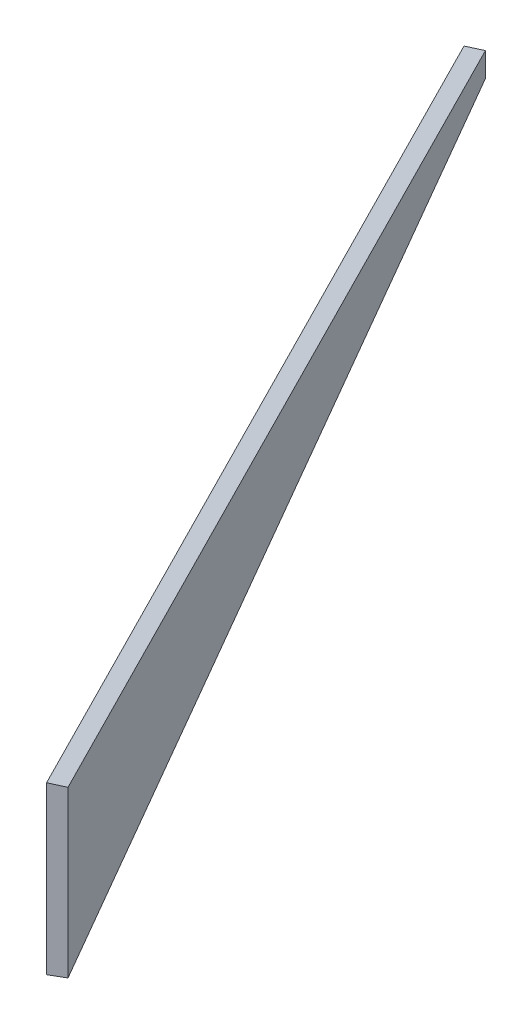
ISO-10303-21;
HEADER;
FILE_DESCRIPTION(('STEP AP214'),'2;1');
FILE_NAME('part.step','',(''),(''),'','','');
FILE_SCHEMA(('AUTOMOTIVE_DESIGN { 1 0 10303 214 1 1 1 1 }'));
ENDSEC;
DATA;
#1=APPLICATION_CONTEXT('core data for automotive mechanical design processes');
#2=APPLICATION_PROTOCOL_DEFINITION('international standard','automotive_design',2000,#1);
#3=PRODUCT_CONTEXT('',#1,'mechanical');
#4=PRODUCT('Part','Part','',(#3));
#5=PRODUCT_RELATED_PRODUCT_CATEGORY('part','',(#4));
#6=PRODUCT_DEFINITION_FORMATION('','',#4);
#7=PRODUCT_DEFINITION_CONTEXT('part definition',#1,'design');
#8=PRODUCT_DEFINITION('design','',#6,#7);
#9=PRODUCT_DEFINITION_SHAPE('','',#8);
#10=(LENGTH_UNIT() NAMED_UNIT(*) SI_UNIT(.MILLI.,.METRE.));
#11=(NAMED_UNIT(*) PLANE_ANGLE_UNIT() SI_UNIT($,.RADIAN.));
#12=(NAMED_UNIT(*) SI_UNIT($,.STERADIAN.) SOLID_ANGLE_UNIT());
#13=UNCERTAINTY_MEASURE_WITH_UNIT(LENGTH_MEASURE(1.E-05),#10,'distance_accuracy_value','');
#14=(GEOMETRIC_REPRESENTATION_CONTEXT(3) GLOBAL_UNCERTAINTY_ASSIGNED_CONTEXT((#13)) GLOBAL_UNIT_ASSIGNED_CONTEXT((#10,
#11,#12)) REPRESENTATION_CONTEXT('',''));
#15=CARTESIAN_POINT('',(0.,0.,0.));
#16=DIRECTION('',(0.,0.,1.));
#17=DIRECTION('',(1.,0.,0.));
#18=AXIS2_PLACEMENT_3D('',#15,#16,#17);
#19=CARTESIAN_POINT('',(473.075,0.,-3427.892719385));
#20=DIRECTION('',(0.866025403784429,0.,-0.500000000000017));
#21=DIRECTION('',(-0.500000000000017,0.,-0.866025403784429));
#22=AXIS2_PLACEMENT_3D('',#19,#20,#21);
#23=PLANE('',#22);
#24=DIRECTION('',(0.,1.,0.));
#25=VECTOR('',#24,1.);
#26=CARTESIAN_POINT('',(10.9985226280619,0.,-4228.23265517386));
#27=LINE('',#26,#25);
#28=CARTESIAN_POINT('',(10.998522628441,19.6298539492593,-4228.23265517409));
#29=VERTEX_POINT('',#28);
#30=CARTESIAN_POINT('',(10.998522628441,0.,-4228.23265517408));
#31=VERTEX_POINT('',#30);
#32=EDGE_CURVE('E20',#29,#31,#27,.F.);
#33=ORIENTED_EDGE('',*,*,#32,.F.);
#34=DIRECTION('',(-0.496226558532445,-0.122624673012515,-0.85948961144136));
#35=VECTOR('',#34,1.);
#36=CARTESIAN_POINT('',(473.075,133.815553949262,-3427.89271938501));
#37=LINE('',#36,#35);
#38=CARTESIAN_POINT('',(473.075000000004,133.8155539492,-3427.892719385));
#39=VERTEX_POINT('',#38);
#40=EDGE_CURVE('E79',#39,#29,#37,.T.);
#41=ORIENTED_EDGE('',*,*,#40,.F.);
#42=DIRECTION('',(0.,1.,0.));
#43=VECTOR('',#42,1.);
#44=CARTESIAN_POINT('',(473.075000000014,0.,-3427.89271938498));
#45=LINE('',#44,#43);
#46=CARTESIAN_POINT('',(473.075000000004,0.,-3427.89271938499));
#47=VERTEX_POINT('',#46);
#48=EDGE_CURVE('E61',#47,#39,#45,.T.);
#49=ORIENTED_EDGE('',*,*,#48,.F.);
#50=DIRECTION('',(-0.500000000000837,0.,-0.866025403783955));
#51=VECTOR('',#50,1.);
#52=CARTESIAN_POINT('',(473.075,0.,-3427.892719385));
#53=LINE('',#52,#51);
#54=EDGE_CURVE('E56',#47,#31,#53,.T.);
#55=ORIENTED_EDGE('',*,*,#54,.T.);
#56=EDGE_LOOP('',(#33,#41,#49,#55));
#57=FACE_BOUND('',#56,.T.);
#58=ADVANCED_FACE('F17',(#57),#23,.T.);
#59=CARTESIAN_POINT('',(10.9985226280619,0.,-4228.23265517386));
#60=DIRECTION('',(-0.499999999999898,0.,-0.866025403784497));
#61=DIRECTION('',(-0.866025403784497,0.,0.499999999999898));
#62=AXIS2_PLACEMENT_3D('',#59,#60,#61);
#63=PLANE('',#62);
#64=DIRECTION('',(0.,1.,0.));
#65=VECTOR('',#64,1.);
#66=CARTESIAN_POINT('',(0.,0.,-4221.88265517386));
#67=LINE('',#66,#65);
#68=CARTESIAN_POINT('',(-4.81062211339158E-13,20.5359000000744,-4221.88265517387));
#69=VERTEX_POINT('',#68);
#70=CARTESIAN_POINT('',(-4.84855211535518E-13,0.,-4221.88265517386));
#71=VERTEX_POINT('',#70);
#72=EDGE_CURVE('E83',#69,#71,#67,.F.);
#73=ORIENTED_EDGE('',*,*,#72,.F.);
#74=DIRECTION('',(-0.86382987180384,0.0711613432450309,0.498732409020032));
#75=VECTOR('',#74,1.);
#76=CARTESIAN_POINT('',(10.9985226280619,19.6298539494827,-4228.2326551739));
#77=LINE('',#76,#75);
#78=EDGE_CURVE('E68',#29,#69,#77,.T.);
#79=ORIENTED_EDGE('',*,*,#78,.F.);
#80=ORIENTED_EDGE('',*,*,#32,.T.);
#81=DIRECTION('',(-0.866025403784419,0.,0.500000000000034));
#82=VECTOR('',#81,1.);
#83=CARTESIAN_POINT('',(10.9985226280619,0.,-4228.23265517386));
#84=LINE('',#83,#82);
#85=EDGE_CURVE('E63',#31,#71,#84,.T.);
#86=ORIENTED_EDGE('',*,*,#85,.T.);
#87=EDGE_LOOP('',(#73,#79,#80,#86));
#88=FACE_BOUND('',#87,.T.);
#89=ADVANCED_FACE('F65',(#88),#63,.T.);
#90=CARTESIAN_POINT('',(0.,0.,0.));
#91=DIRECTION('',(0.,1.,0.));
#92=DIRECTION('',(0.,0.,1.));
#93=AXIS2_PLACEMENT_3D('',#90,#91,#92);
#94=PLANE('',#93);
#95=DIRECTION('',(0.500000000000017,0.,0.866025403784429));
#96=VECTOR('',#95,1.);
#97=CARTESIAN_POINT('',(0.,0.,-4221.88265517386));
#98=LINE('',#97,#96);
#99=CARTESIAN_POINT('',(462.076477371794,0.,-3421.54271938488));
#100=VERTEX_POINT('',#99);
#101=EDGE_CURVE('E72',#71,#100,#98,.T.);
#102=ORIENTED_EDGE('',*,*,#101,.F.);
#103=ORIENTED_EDGE('',*,*,#85,.F.);
#104=ORIENTED_EDGE('',*,*,#54,.F.);
#105=DIRECTION('',(0.866025403784454,0.,-0.499999999999973));
#106=VECTOR('',#105,1.);
#107=CARTESIAN_POINT('',(462.076477371994,0.,-3421.542719385));
#108=LINE('',#107,#106);
#109=EDGE_CURVE('E74',#100,#47,#108,.T.);
#110=ORIENTED_EDGE('',*,*,#109,.F.);
#111=EDGE_LOOP('',(#102,#103,#104,#110));
#112=FACE_BOUND('',#111,.T.);
#113=ADVANCED_FACE('F70',(#112),#94,.F.);
#114=CARTESIAN_POINT('',(462.076477371994,0.,-3421.542719385));
#115=DIRECTION('',(0.499999999999973,0.,0.866025403784454));
#116=DIRECTION('',(0.866025403784454,0.,-0.499999999999973));
#117=AXIS2_PLACEMENT_3D('',#114,#115,#116);
#118=PLANE('',#117);
#119=ORIENTED_EDGE('',*,*,#48,.T.);
#120=DIRECTION('',(0.863829871802724,-0.0711613432453022,-0.498732409021926));
#121=VECTOR('',#120,1.);
#122=CARTESIAN_POINT('',(462.076477371994,134.721600000077,-3421.54271938501));
#123=LINE('',#122,#121);
#124=CARTESIAN_POINT('',(462.076477371794,134.721600000019,-3421.54271938489));
#125=VERTEX_POINT('',#124);
#126=EDGE_CURVE('E35',#125,#39,#123,.T.);
#127=ORIENTED_EDGE('',*,*,#126,.F.);
#128=DIRECTION('',(0.,1.,0.));
#129=VECTOR('',#128,1.);
#130=CARTESIAN_POINT('',(462.076477371194,0.,-3421.54271938454));
#131=LINE('',#130,#129);
#132=EDGE_CURVE('E26',#100,#125,#131,.T.);
#133=ORIENTED_EDGE('',*,*,#132,.F.);
#134=ORIENTED_EDGE('',*,*,#109,.T.);
#135=EDGE_LOOP('',(#119,#127,#133,#134));
#136=FACE_BOUND('',#135,.T.);
#137=ADVANCED_FACE('F89',(#136),#118,.T.);
#138=CARTESIAN_POINT('',(236.5375,77.1757269746026,-3824.8876872807));
#139=DIRECTION('',(5.53688930002294E-06,0.989974759582632,-0.141244381688805));
#140=DIRECTION('',(0.,0.14124438169097,0.989974759597807));
#141=AXIS2_PLACEMENT_3D('',#138,#139,#140);
#142=PLANE('',#141);
#143=DIRECTION('',(-0.49622655853163,-0.122624673012748,-0.859489611441797));
#144=VECTOR('',#143,1.);
#145=CARTESIAN_POINT('',(462.076477371194,134.7216,-3421.54271938454));
#146=LINE('',#145,#144);
#147=EDGE_CURVE('E11',#125,#69,#146,.T.);
#148=ORIENTED_EDGE('',*,*,#147,.F.);
#149=ORIENTED_EDGE('',*,*,#126,.T.);
#150=ORIENTED_EDGE('',*,*,#40,.T.);
#151=ORIENTED_EDGE('',*,*,#78,.T.);
#152=EDGE_LOOP('',(#148,#149,#150,#151));
#153=FACE_BOUND('',#152,.T.);
#154=ADVANCED_FACE('F91',(#153),#142,.T.);
#155=CARTESIAN_POINT('',(0.,0.,-4221.88265517386));
#156=DIRECTION('',(-0.866025403784429,0.,0.500000000000017));
#157=DIRECTION('',(0.500000000000017,0.,0.866025403784429));
#158=AXIS2_PLACEMENT_3D('',#155,#156,#157);
#159=PLANE('',#158);
#160=ORIENTED_EDGE('',*,*,#132,.T.);
#161=ORIENTED_EDGE('',*,*,#147,.T.);
#162=ORIENTED_EDGE('',*,*,#72,.T.);
#163=ORIENTED_EDGE('',*,*,#101,.T.);
#164=EDGE_LOOP('',(#160,#161,#162,#163));
#165=FACE_BOUND('',#164,.T.);
#166=ADVANCED_FACE('F88',(#165),#159,.T.);
#167=CLOSED_SHELL('',(#58,#89,#113,#137,#154,#166));
#168=MANIFOLD_SOLID_BREP('B1',#167);
#169=ADVANCED_BREP_SHAPE_REPRESENTATION('',(#18,#168),#14);
#170=SHAPE_DEFINITION_REPRESENTATION(#9,#169);
ENDSEC;
END-ISO-10303-21;
